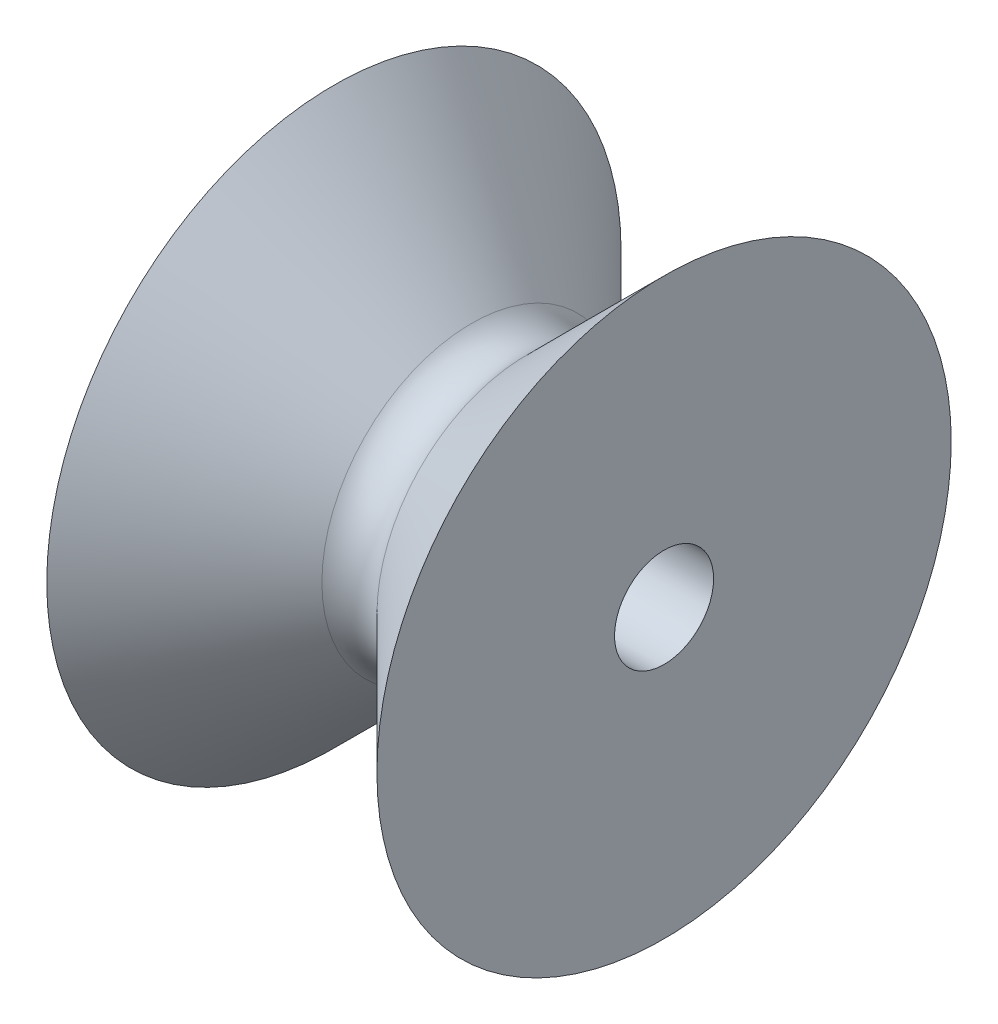
ISO-10303-21;
HEADER;
FILE_DESCRIPTION(('STEP AP214'),'2;1');
FILE_NAME('part.step','',(''),(''),'','','');
FILE_SCHEMA(('AUTOMOTIVE_DESIGN { 1 0 10303 214 1 1 1 1 }'));
ENDSEC;
DATA;
#1=APPLICATION_CONTEXT('core data for automotive mechanical design processes');
#2=APPLICATION_PROTOCOL_DEFINITION('international standard','automotive_design',2000,#1);
#3=PRODUCT_CONTEXT('',#1,'mechanical');
#4=PRODUCT('Part','Part','',(#3));
#5=PRODUCT_RELATED_PRODUCT_CATEGORY('part','',(#4));
#6=PRODUCT_DEFINITION_FORMATION('','',#4);
#7=PRODUCT_DEFINITION_CONTEXT('part definition',#1,'design');
#8=PRODUCT_DEFINITION('design','',#6,#7);
#9=PRODUCT_DEFINITION_SHAPE('','',#8);
#10=(LENGTH_UNIT() NAMED_UNIT(*) SI_UNIT(.MILLI.,.METRE.));
#11=(NAMED_UNIT(*) PLANE_ANGLE_UNIT() SI_UNIT($,.RADIAN.));
#12=(NAMED_UNIT(*) SI_UNIT($,.STERADIAN.) SOLID_ANGLE_UNIT());
#13=UNCERTAINTY_MEASURE_WITH_UNIT(LENGTH_MEASURE(1.E-05),#10,'distance_accuracy_value','');
#14=(GEOMETRIC_REPRESENTATION_CONTEXT(3) GLOBAL_UNCERTAINTY_ASSIGNED_CONTEXT((#13)) GLOBAL_UNIT_ASSIGNED_CONTEXT((#10,
#11,#12)) REPRESENTATION_CONTEXT('',''));
#15=CARTESIAN_POINT('',(0.,0.,0.));
#16=DIRECTION('',(0.,0.,1.));
#17=DIRECTION('',(1.,0.,0.));
#18=AXIS2_PLACEMENT_3D('',#15,#16,#17);
#19=CARTESIAN_POINT('',(18.,0.,0.));
#20=DIRECTION('',(1.,0.,0.));
#21=DIRECTION('',(0.,0.,-1.));
#22=AXIS2_PLACEMENT_3D('',#19,#20,#21);
#23=PLANE('',#22);
#24=CARTESIAN_POINT('',(18.,0.,0.));
#25=DIRECTION('',(1.,0.,0.));
#26=DIRECTION('',(0.,0.,-1.));
#27=AXIS2_PLACEMENT_3D('',#24,#25,#26);
#28=CIRCLE('',#27,2.7);
#29=CARTESIAN_POINT('',(18.,0.,-2.7));
#30=VERTEX_POINT('',#29);
#31=EDGE_CURVE('E39',#30,#30,#28,.T.);
#32=ORIENTED_EDGE('',*,*,#31,.F.);
#33=EDGE_LOOP('',(#32));
#34=FACE_BOUND('',#33,.T.);
#35=CARTESIAN_POINT('',(18.,0.,0.));
#36=DIRECTION('',(1.,0.,0.));
#37=DIRECTION('',(0.,0.,-1.));
#38=AXIS2_PLACEMENT_3D('',#35,#36,#37);
#39=CIRCLE('',#38,15.6555637918234);
#40=CARTESIAN_POINT('',(18.,0.,-15.6555637918234));
#41=VERTEX_POINT('',#40);
#42=EDGE_CURVE('E35',#41,#41,#39,.T.);
#43=ORIENTED_EDGE('',*,*,#42,.T.);
#44=EDGE_LOOP('',(#43));
#45=FACE_BOUND('',#44,.T.);
#46=ADVANCED_FACE('F31',(#34,#45),#23,.T.);
#47=CARTESIAN_POINT('',(0.,0.,0.));
#48=DIRECTION('',(1.,0.,0.));
#49=DIRECTION('',(0.,0.,-1.));
#50=AXIS2_PLACEMENT_3D('',#47,#48,#49);
#51=PLANE('',#50);
#52=CARTESIAN_POINT('',(0.,0.,0.));
#53=DIRECTION('',(1.,0.,0.));
#54=DIRECTION('',(0.,0.,-1.));
#55=AXIS2_PLACEMENT_3D('',#52,#53,#54);
#56=CIRCLE('',#55,2.7);
#57=CARTESIAN_POINT('',(0.,0.,-2.7));
#58=VERTEX_POINT('',#57);
#59=EDGE_CURVE('E10',#58,#58,#56,.T.);
#60=ORIENTED_EDGE('',*,*,#59,.T.);
#61=EDGE_LOOP('',(#60));
#62=FACE_BOUND('',#61,.T.);
#63=CARTESIAN_POINT('',(0.,0.,0.));
#64=DIRECTION('',(1.,0.,0.));
#65=DIRECTION('',(0.,0.,-1.));
#66=AXIS2_PLACEMENT_3D('',#63,#64,#65);
#67=CIRCLE('',#66,15.6555637918234);
#68=CARTESIAN_POINT('',(0.,0.,-15.6555637918234));
#69=VERTEX_POINT('',#68);
#70=EDGE_CURVE('E48',#69,#69,#67,.T.);
#71=ORIENTED_EDGE('',*,*,#70,.F.);
#72=EDGE_LOOP('',(#71));
#73=FACE_BOUND('',#72,.T.);
#74=ADVANCED_FACE('F33',(#62,#73),#51,.F.);
#75=CARTESIAN_POINT('',(0.,0.,0.));
#76=DIRECTION('',(1.,0.,0.));
#77=DIRECTION('',(0.,0.,-1.));
#78=AXIS2_PLACEMENT_3D('',#75,#76,#77);
#79=CYLINDRICAL_SURFACE('',#78,2.7);
#80=ORIENTED_EDGE('',*,*,#59,.F.);
#81=EDGE_LOOP('',(#80));
#82=FACE_BOUND('',#81,.T.);
#83=ORIENTED_EDGE('',*,*,#31,.T.);
#84=EDGE_LOOP('',(#83));
#85=FACE_BOUND('',#84,.T.);
#86=ADVANCED_FACE('F78',(#82,#85),#79,.F.);
#87=CARTESIAN_POINT('',(-6.90081300773285,0.,0.));
#88=DIRECTION('',(-1.,0.,0.));
#89=DIRECTION('',(0.,0.,1.));
#90=AXIS2_PLACEMENT_3D('',#87,#88,#89);
#91=CONICAL_SURFACE('',#90,22.5563767995562,0.785398163397448);
#92=CARTESIAN_POINT('',(7.5,0.,0.));
#93=DIRECTION('',(-1.,0.,0.));
#94=DIRECTION('',(0.,0.,1.));
#95=AXIS2_PLACEMENT_3D('',#92,#93,#94);
#96=CIRCLE('',#95,8.15556379182339);
#97=CARTESIAN_POINT('',(7.5,0.,8.15556379182339));
#98=VERTEX_POINT('',#97);
#99=EDGE_CURVE('E46',#98,#98,#96,.T.);
#100=ORIENTED_EDGE('',*,*,#99,.T.);
#101=EDGE_LOOP('',(#100));
#102=FACE_BOUND('',#101,.T.);
#103=ORIENTED_EDGE('',*,*,#70,.T.);
#104=EDGE_LOOP('',(#103));
#105=FACE_BOUND('',#104,.T.);
#106=ADVANCED_FACE('F70',(#102,#105),#91,.T.);
#107=CARTESIAN_POINT('',(9.,0.,0.));
#108=DIRECTION('',(-1.,0.,0.));
#109=DIRECTION('',(0.,0.,1.));
#110=AXIS2_PLACEMENT_3D('',#107,#108,#109);
#111=TOROIDAL_SURFACE('',#110,9.65556379182339,2.12132034355964);
#112=CARTESIAN_POINT('',(10.5,0.,0.));
#113=DIRECTION('',(-1.,0.,0.));
#114=DIRECTION('',(0.,0.,1.));
#115=AXIS2_PLACEMENT_3D('',#112,#113,#114);
#116=CIRCLE('',#115,8.15556379182339);
#117=CARTESIAN_POINT('',(10.5,0.,8.15556379182339));
#118=VERTEX_POINT('',#117);
#119=EDGE_CURVE('E54',#118,#118,#116,.T.);
#120=ORIENTED_EDGE('',*,*,#119,.T.);
#121=EDGE_LOOP('',(#120));
#122=FACE_BOUND('',#121,.T.);
#123=ORIENTED_EDGE('',*,*,#99,.F.);
#124=EDGE_LOOP('',(#123));
#125=FACE_BOUND('',#124,.T.);
#126=ADVANCED_FACE('F60',(#122,#125),#111,.F.);
#127=CARTESIAN_POINT('',(10.5,0.,0.));
#128=DIRECTION('',(1.,0.,0.));
#129=DIRECTION('',(0.,0.,-1.));
#130=AXIS2_PLACEMENT_3D('',#127,#128,#129);
#131=CONICAL_SURFACE('',#130,8.15556379182339,0.785398163397449);
#132=ORIENTED_EDGE('',*,*,#42,.F.);
#133=EDGE_LOOP('',(#132));
#134=FACE_BOUND('',#133,.T.);
#135=ORIENTED_EDGE('',*,*,#119,.F.);
#136=EDGE_LOOP('',(#135));
#137=FACE_BOUND('',#136,.T.);
#138=ADVANCED_FACE('F63',(#134,#137),#131,.T.);
#139=CLOSED_SHELL('',(#46,#74,#86,#106,#126,#138));
#140=MANIFOLD_SOLID_BREP('B2',#139);
#141=ADVANCED_BREP_SHAPE_REPRESENTATION('',(#18,#140),#14);
#142=SHAPE_DEFINITION_REPRESENTATION(#9,#141);
ENDSEC;
END-ISO-10303-21;
